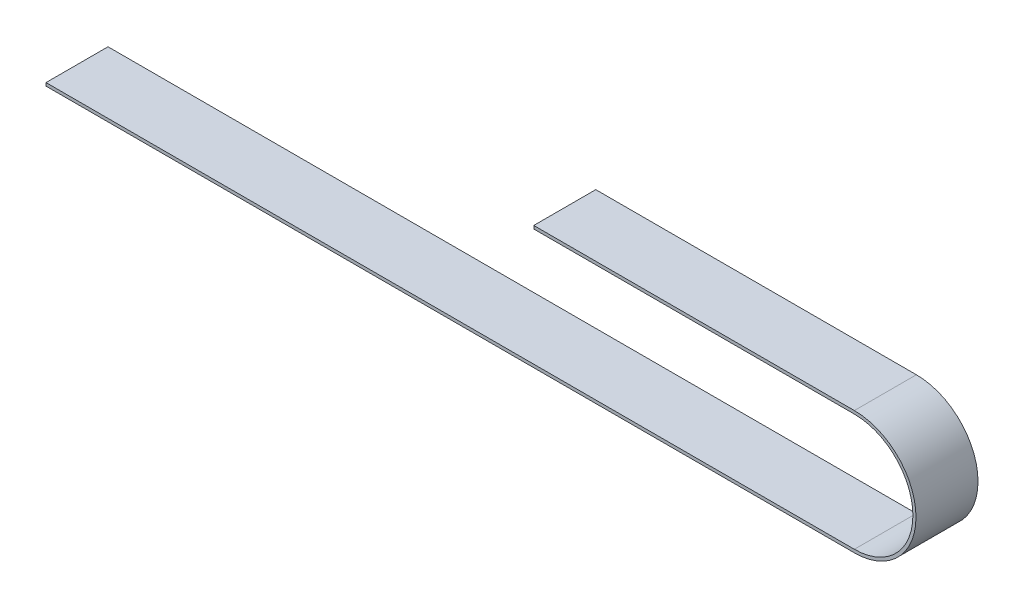
ISO-10303-21;
HEADER;
FILE_DESCRIPTION(('STEP AP214'),'2;1');
FILE_NAME('part.step','',(''),(''),'','','');
FILE_SCHEMA(('AUTOMOTIVE_DESIGN { 1 0 10303 214 1 1 1 1 }'));
ENDSEC;
DATA;
#1=APPLICATION_CONTEXT('core data for automotive mechanical design processes');
#2=APPLICATION_PROTOCOL_DEFINITION('international standard','automotive_design',2000,#1);
#3=PRODUCT_CONTEXT('',#1,'mechanical');
#4=PRODUCT('Part','Part','',(#3));
#5=PRODUCT_RELATED_PRODUCT_CATEGORY('part','',(#4));
#6=PRODUCT_DEFINITION_FORMATION('','',#4);
#7=PRODUCT_DEFINITION_CONTEXT('part definition',#1,'design');
#8=PRODUCT_DEFINITION('design','',#6,#7);
#9=PRODUCT_DEFINITION_SHAPE('','',#8);
#10=(LENGTH_UNIT() NAMED_UNIT(*) SI_UNIT(.MILLI.,.METRE.));
#11=(NAMED_UNIT(*) PLANE_ANGLE_UNIT() SI_UNIT($,.RADIAN.));
#12=(NAMED_UNIT(*) SI_UNIT($,.STERADIAN.) SOLID_ANGLE_UNIT());
#13=UNCERTAINTY_MEASURE_WITH_UNIT(LENGTH_MEASURE(1.E-05),#10,'distance_accuracy_value','');
#14=(GEOMETRIC_REPRESENTATION_CONTEXT(3) GLOBAL_UNCERTAINTY_ASSIGNED_CONTEXT((#13)) GLOBAL_UNIT_ASSIGNED_CONTEXT((#10,
#11,#12)) REPRESENTATION_CONTEXT('',''));
#15=CARTESIAN_POINT('',(0.,0.,0.));
#16=DIRECTION('',(0.,0.,1.));
#17=DIRECTION('',(1.,0.,0.));
#18=AXIS2_PLACEMENT_3D('',#15,#16,#17);
#19=CARTESIAN_POINT('',(521.447237602523,133.5,-45.));
#20=DIRECTION('',(0.,1.,0.));
#21=DIRECTION('',(-1.,0.,0.));
#22=AXIS2_PLACEMENT_3D('',#19,#20,#21);
#23=PLANE('',#22);
#24=DIRECTION('',(-1.,0.,0.));
#25=VECTOR('',#24,1.);
#26=CARTESIAN_POINT('',(521.447237602523,133.5,-5.));
#27=LINE('',#26,#25);
#28=CARTESIAN_POINT('',(521.447237602523,133.5,-5.));
#29=VERTEX_POINT('',#28);
#30=CARTESIAN_POINT('',(314.63119053165,133.5,-5.));
#31=VERTEX_POINT('',#30);
#32=EDGE_CURVE('E125',#29,#31,#27,.T.);
#33=ORIENTED_EDGE('',*,*,#32,.F.);
#34=DIRECTION('',(0.,0.,1.));
#35=VECTOR('',#34,1.);
#36=CARTESIAN_POINT('',(521.447237602523,133.5,-45.));
#37=LINE('',#36,#35);
#38=CARTESIAN_POINT('',(521.447237602523,133.5,-45.));
#39=VERTEX_POINT('',#38);
#40=EDGE_CURVE('E11',#39,#29,#37,.T.);
#41=ORIENTED_EDGE('',*,*,#40,.F.);
#42=DIRECTION('',(-1.,0.,0.));
#43=VECTOR('',#42,1.);
#44=CARTESIAN_POINT('',(521.447237602523,133.5,-45.));
#45=LINE('',#44,#43);
#46=CARTESIAN_POINT('',(314.63119053165,133.5,-45.));
#47=VERTEX_POINT('',#46);
#48=EDGE_CURVE('E142',#39,#47,#45,.T.);
#49=ORIENTED_EDGE('',*,*,#48,.T.);
#50=DIRECTION('',(0.,0.,1.));
#51=VECTOR('',#50,1.);
#52=CARTESIAN_POINT('',(314.63119053165,133.5,-45.));
#53=LINE('',#52,#51);
#54=EDGE_CURVE('E35',#47,#31,#53,.T.);
#55=ORIENTED_EDGE('',*,*,#54,.T.);
#56=EDGE_LOOP('',(#33,#41,#49,#55));
#57=FACE_BOUND('',#56,.T.);
#58=ADVANCED_FACE('F32',(#57),#23,.T.);
#59=CARTESIAN_POINT('',(521.447237602523,93.75,-45.));
#60=DIRECTION('',(0.,0.,1.));
#61=DIRECTION('',(1.,0.,0.));
#62=AXIS2_PLACEMENT_3D('',#59,#60,#61);
#63=CYLINDRICAL_SURFACE('',#62,39.7499999999999);
#64=CARTESIAN_POINT('',(521.447237602523,93.75,-5.));
#65=DIRECTION('',(0.,0.,1.));
#66=DIRECTION('',(1.,0.,0.));
#67=AXIS2_PLACEMENT_3D('',#64,#65,#66);
#68=CIRCLE('',#67,39.7499999999999);
#69=CARTESIAN_POINT('',(521.447237602523,54.0000000000001,-5.));
#70=VERTEX_POINT('',#69);
#71=EDGE_CURVE('E140',#70,#29,#68,.T.);
#72=ORIENTED_EDGE('',*,*,#71,.F.);
#73=DIRECTION('',(0.,0.,1.));
#74=VECTOR('',#73,1.);
#75=CARTESIAN_POINT('',(521.447237602523,54.0000000000001,-45.));
#76=LINE('',#75,#74);
#77=CARTESIAN_POINT('',(521.447237602523,54.0000000000001,-45.));
#78=VERTEX_POINT('',#77);
#79=EDGE_CURVE('E41',#78,#70,#76,.T.);
#80=ORIENTED_EDGE('',*,*,#79,.F.);
#81=CARTESIAN_POINT('',(521.447237602523,93.75,-45.));
#82=DIRECTION('',(0.,0.,1.));
#83=DIRECTION('',(1.,0.,0.));
#84=AXIS2_PLACEMENT_3D('',#81,#82,#83);
#85=CIRCLE('',#84,39.7499999999999);
#86=EDGE_CURVE('E120',#78,#39,#85,.T.);
#87=ORIENTED_EDGE('',*,*,#86,.T.);
#88=ORIENTED_EDGE('',*,*,#40,.T.);
#89=EDGE_LOOP('',(#72,#80,#87,#88));
#90=FACE_BOUND('',#89,.T.);
#91=ADVANCED_FACE('F160',(#90),#63,.T.);
#92=CARTESIAN_POINT('',(0.,54.,-45.));
#93=DIRECTION('',(0.,-1.,0.));
#94=DIRECTION('',(1.,0.,0.));
#95=AXIS2_PLACEMENT_3D('',#92,#93,#94);
#96=PLANE('',#95);
#97=DIRECTION('',(1.,0.,0.));
#98=VECTOR('',#97,1.);
#99=CARTESIAN_POINT('',(0.,54.,-5.));
#100=LINE('',#99,#98);
#101=CARTESIAN_POINT('',(0.,54.,-5.));
#102=VERTEX_POINT('',#101);
#103=EDGE_CURVE('E107',#102,#70,#100,.T.);
#104=ORIENTED_EDGE('',*,*,#103,.F.);
#105=DIRECTION('',(0.,0.,1.));
#106=VECTOR('',#105,1.);
#107=CARTESIAN_POINT('',(0.,54.,-45.));
#108=LINE('',#107,#106);
#109=CARTESIAN_POINT('',(0.,54.,-45.));
#110=VERTEX_POINT('',#109);
#111=EDGE_CURVE('E101',#110,#102,#108,.T.);
#112=ORIENTED_EDGE('',*,*,#111,.F.);
#113=DIRECTION('',(1.,0.,0.));
#114=VECTOR('',#113,1.);
#115=CARTESIAN_POINT('',(0.,54.,-45.));
#116=LINE('',#115,#114);
#117=EDGE_CURVE('E105',#110,#78,#116,.T.);
#118=ORIENTED_EDGE('',*,*,#117,.T.);
#119=ORIENTED_EDGE('',*,*,#79,.T.);
#120=EDGE_LOOP('',(#104,#112,#118,#119));
#121=FACE_BOUND('',#120,.T.);
#122=ADVANCED_FACE('F103',(#121),#96,.T.);
#123=CARTESIAN_POINT('',(0.,54.,-45.));
#124=DIRECTION('',(1.,0.,0.));
#125=DIRECTION('',(0.,1.,0.));
#126=AXIS2_PLACEMENT_3D('',#123,#124,#125);
#127=PLANE('',#126);
#128=DIRECTION('',(0.,1.,0.));
#129=VECTOR('',#128,1.);
#130=CARTESIAN_POINT('',(0.,54.,-5.));
#131=LINE('',#130,#129);
#132=CARTESIAN_POINT('',(0.,56.,-5.));
#133=VERTEX_POINT('',#132);
#134=EDGE_CURVE('E137',#102,#133,#131,.T.);
#135=ORIENTED_EDGE('',*,*,#134,.T.);
#136=DIRECTION('',(0.,0.,1.));
#137=VECTOR('',#136,1.);
#138=CARTESIAN_POINT('',(0.,56.,-45.));
#139=LINE('',#138,#137);
#140=CARTESIAN_POINT('',(0.,56.,-45.));
#141=VERTEX_POINT('',#140);
#142=EDGE_CURVE('E110',#141,#133,#139,.T.);
#143=ORIENTED_EDGE('',*,*,#142,.F.);
#144=DIRECTION('',(0.,1.,0.));
#145=VECTOR('',#144,1.);
#146=CARTESIAN_POINT('',(0.,54.,-45.));
#147=LINE('',#146,#145);
#148=EDGE_CURVE('E113',#110,#141,#147,.T.);
#149=ORIENTED_EDGE('',*,*,#148,.F.);
#150=ORIENTED_EDGE('',*,*,#111,.T.);
#151=EDGE_LOOP('',(#135,#143,#149,#150));
#152=FACE_BOUND('',#151,.T.);
#153=ADVANCED_FACE('F114',(#152),#127,.F.);
#154=CARTESIAN_POINT('',(0.,56.,-45.));
#155=DIRECTION('',(0.,-1.,0.));
#156=DIRECTION('',(1.,0.,0.));
#157=AXIS2_PLACEMENT_3D('',#154,#155,#156);
#158=PLANE('',#157);
#159=DIRECTION('',(1.,0.,0.));
#160=VECTOR('',#159,1.);
#161=CARTESIAN_POINT('',(0.,56.,-5.));
#162=LINE('',#161,#160);
#163=CARTESIAN_POINT('',(521.447237602523,56.0000000000001,-5.));
#164=VERTEX_POINT('',#163);
#165=EDGE_CURVE('E135',#133,#164,#162,.T.);
#166=ORIENTED_EDGE('',*,*,#165,.T.);
#167=DIRECTION('',(0.,0.,1.));
#168=VECTOR('',#167,1.);
#169=CARTESIAN_POINT('',(521.447237602523,56.0000000000001,-45.));
#170=LINE('',#169,#168);
#171=CARTESIAN_POINT('',(521.447237602523,56.0000000000001,-45.));
#172=VERTEX_POINT('',#171);
#173=EDGE_CURVE('E146',#172,#164,#170,.T.);
#174=ORIENTED_EDGE('',*,*,#173,.F.);
#175=DIRECTION('',(1.,0.,0.));
#176=VECTOR('',#175,1.);
#177=CARTESIAN_POINT('',(0.,56.,-45.));
#178=LINE('',#177,#176);
#179=EDGE_CURVE('E117',#141,#172,#178,.T.);
#180=ORIENTED_EDGE('',*,*,#179,.F.);
#181=ORIENTED_EDGE('',*,*,#142,.T.);
#182=EDGE_LOOP('',(#166,#174,#180,#181));
#183=FACE_BOUND('',#182,.T.);
#184=ADVANCED_FACE('F173',(#183),#158,.F.);
#185=CARTESIAN_POINT('',(521.447237602523,93.75,-45.));
#186=DIRECTION('',(0.,0.,1.));
#187=DIRECTION('',(1.,0.,0.));
#188=AXIS2_PLACEMENT_3D('',#185,#186,#187);
#189=CYLINDRICAL_SURFACE('',#188,37.7499999999999);
#190=CARTESIAN_POINT('',(521.447237602523,93.75,-5.));
#191=DIRECTION('',(0.,0.,1.));
#192=DIRECTION('',(1.,0.,0.));
#193=AXIS2_PLACEMENT_3D('',#190,#191,#192);
#194=CIRCLE('',#193,37.7499999999999);
#195=CARTESIAN_POINT('',(521.447237602523,131.5,-5.));
#196=VERTEX_POINT('',#195);
#197=EDGE_CURVE('E133',#164,#196,#194,.T.);
#198=ORIENTED_EDGE('',*,*,#197,.T.);
#199=DIRECTION('',(0.,0.,1.));
#200=VECTOR('',#199,1.);
#201=CARTESIAN_POINT('',(521.447237602523,131.5,-45.));
#202=LINE('',#201,#200);
#203=CARTESIAN_POINT('',(521.447237602523,131.5,-45.));
#204=VERTEX_POINT('',#203);
#205=EDGE_CURVE('E149',#204,#196,#202,.T.);
#206=ORIENTED_EDGE('',*,*,#205,.F.);
#207=CARTESIAN_POINT('',(521.447237602523,93.75,-45.));
#208=DIRECTION('',(0.,0.,1.));
#209=DIRECTION('',(1.,0.,0.));
#210=AXIS2_PLACEMENT_3D('',#207,#208,#209);
#211=CIRCLE('',#210,37.7499999999999);
#212=EDGE_CURVE('E251',#172,#204,#211,.T.);
#213=ORIENTED_EDGE('',*,*,#212,.F.);
#214=ORIENTED_EDGE('',*,*,#173,.T.);
#215=EDGE_LOOP('',(#198,#206,#213,#214));
#216=FACE_BOUND('',#215,.T.);
#217=ADVANCED_FACE('F176',(#216),#189,.F.);
#218=CARTESIAN_POINT('',(521.447237602523,131.5,-45.));
#219=DIRECTION('',(0.,1.,0.));
#220=DIRECTION('',(-1.,0.,0.));
#221=AXIS2_PLACEMENT_3D('',#218,#219,#220);
#222=PLANE('',#221);
#223=DIRECTION('',(-1.,0.,0.));
#224=VECTOR('',#223,1.);
#225=CARTESIAN_POINT('',(521.447237602523,131.5,-5.));
#226=LINE('',#225,#224);
#227=CARTESIAN_POINT('',(314.63119053165,131.5,-5.));
#228=VERTEX_POINT('',#227);
#229=EDGE_CURVE('E131',#196,#228,#226,.T.);
#230=ORIENTED_EDGE('',*,*,#229,.T.);
#231=DIRECTION('',(0.,0.,1.));
#232=VECTOR('',#231,1.);
#233=CARTESIAN_POINT('',(314.63119053165,131.5,-45.));
#234=LINE('',#233,#232);
#235=CARTESIAN_POINT('',(314.63119053165,131.5,-45.));
#236=VERTEX_POINT('',#235);
#237=EDGE_CURVE('E151',#236,#228,#234,.T.);
#238=ORIENTED_EDGE('',*,*,#237,.F.);
#239=DIRECTION('',(-1.,0.,0.));
#240=VECTOR('',#239,1.);
#241=CARTESIAN_POINT('',(521.447237602523,131.5,-45.));
#242=LINE('',#241,#240);
#243=EDGE_CURVE('E252',#204,#236,#242,.T.);
#244=ORIENTED_EDGE('',*,*,#243,.F.);
#245=ORIENTED_EDGE('',*,*,#205,.T.);
#246=EDGE_LOOP('',(#230,#238,#244,#245));
#247=FACE_BOUND('',#246,.T.);
#248=ADVANCED_FACE('F180',(#247),#222,.F.);
#249=CARTESIAN_POINT('',(314.63119053165,131.5,-45.));
#250=DIRECTION('',(1.,0.,0.));
#251=DIRECTION('',(0.,0.,-1.));
#252=AXIS2_PLACEMENT_3D('',#249,#250,#251);
#253=PLANE('',#252);
#254=DIRECTION('',(0.,1.,0.));
#255=VECTOR('',#254,1.);
#256=CARTESIAN_POINT('',(314.63119053165,131.5,-5.));
#257=LINE('',#256,#255);
#258=EDGE_CURVE('E128',#228,#31,#257,.T.);
#259=ORIENTED_EDGE('',*,*,#258,.T.);
#260=ORIENTED_EDGE('',*,*,#54,.F.);
#261=DIRECTION('',(0.,1.,0.));
#262=VECTOR('',#261,1.);
#263=CARTESIAN_POINT('',(314.63119053165,131.5,-45.));
#264=LINE('',#263,#262);
#265=EDGE_CURVE('E88',#236,#47,#264,.T.);
#266=ORIENTED_EDGE('',*,*,#265,.F.);
#267=ORIENTED_EDGE('',*,*,#237,.T.);
#268=EDGE_LOOP('',(#259,#260,#266,#267));
#269=FACE_BOUND('',#268,.T.);
#270=ADVANCED_FACE('F156',(#269),#253,.F.);
#271=CARTESIAN_POINT('',(521.447237602523,93.75,-45.));
#272=DIRECTION('',(0.,0.,1.));
#273=DIRECTION('',(1.,0.,0.));
#274=AXIS2_PLACEMENT_3D('',#271,#272,#273);
#275=PLANE('',#274);
#276=ORIENTED_EDGE('',*,*,#48,.F.);
#277=ORIENTED_EDGE('',*,*,#86,.F.);
#278=ORIENTED_EDGE('',*,*,#117,.F.);
#279=ORIENTED_EDGE('',*,*,#148,.T.);
#280=ORIENTED_EDGE('',*,*,#179,.T.);
#281=ORIENTED_EDGE('',*,*,#212,.T.);
#282=ORIENTED_EDGE('',*,*,#243,.T.);
#283=ORIENTED_EDGE('',*,*,#265,.T.);
#284=EDGE_LOOP('',(#276,#277,#278,#279,#280,#281,#282,#283));
#285=FACE_BOUND('',#284,.T.);
#286=ADVANCED_FACE('F119',(#285),#275,.F.);
#287=CARTESIAN_POINT('',(521.447237602523,93.75,-5.));
#288=DIRECTION('',(0.,0.,1.));
#289=DIRECTION('',(1.,0.,0.));
#290=AXIS2_PLACEMENT_3D('',#287,#288,#289);
#291=PLANE('',#290);
#292=ORIENTED_EDGE('',*,*,#32,.T.);
#293=ORIENTED_EDGE('',*,*,#258,.F.);
#294=ORIENTED_EDGE('',*,*,#229,.F.);
#295=ORIENTED_EDGE('',*,*,#197,.F.);
#296=ORIENTED_EDGE('',*,*,#165,.F.);
#297=ORIENTED_EDGE('',*,*,#134,.F.);
#298=ORIENTED_EDGE('',*,*,#103,.T.);
#299=ORIENTED_EDGE('',*,*,#71,.T.);
#300=EDGE_LOOP('',(#292,#293,#294,#295,#296,#297,#298,#299));
#301=FACE_BOUND('',#300,.T.);
#302=ADVANCED_FACE('F159',(#301),#291,.T.);
#303=CLOSED_SHELL('',(#58,#91,#122,#153,#184,#217,#248,#270,#286,#302));
#304=MANIFOLD_SOLID_BREP('B2',#303);
#305=ADVANCED_BREP_SHAPE_REPRESENTATION('',(#18,#304),#14);
#306=SHAPE_DEFINITION_REPRESENTATION(#9,#305);
ENDSEC;
END-ISO-10303-21;
